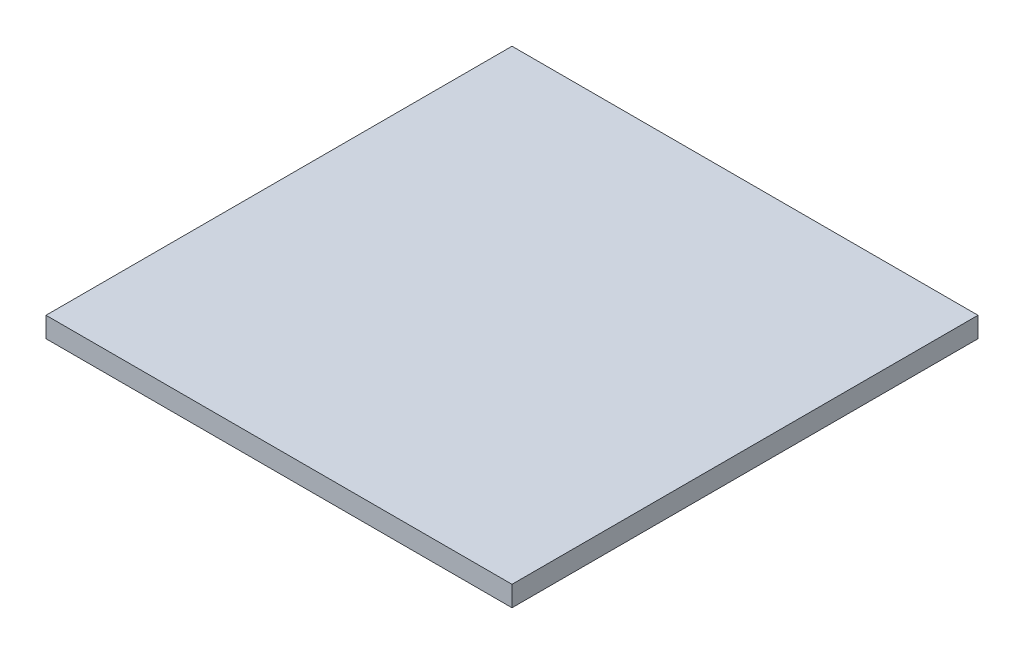
ISO-10303-21;
HEADER;
FILE_DESCRIPTION(('STEP AP214'),'2;1');
FILE_NAME('part.step','',(''),(''),'','','');
FILE_SCHEMA(('AUTOMOTIVE_DESIGN { 1 0 10303 214 1 1 1 1 }'));
ENDSEC;
DATA;
#1=APPLICATION_CONTEXT('core data for automotive mechanical design processes');
#2=APPLICATION_PROTOCOL_DEFINITION('international standard','automotive_design',2000,#1);
#3=PRODUCT_CONTEXT('',#1,'mechanical');
#4=PRODUCT('Part','Part','',(#3));
#5=PRODUCT_RELATED_PRODUCT_CATEGORY('part','',(#4));
#6=PRODUCT_DEFINITION_FORMATION('','',#4);
#7=PRODUCT_DEFINITION_CONTEXT('part definition',#1,'design');
#8=PRODUCT_DEFINITION('design','',#6,#7);
#9=PRODUCT_DEFINITION_SHAPE('','',#8);
#10=(LENGTH_UNIT() NAMED_UNIT(*) SI_UNIT(.MILLI.,.METRE.));
#11=(NAMED_UNIT(*) PLANE_ANGLE_UNIT() SI_UNIT($,.RADIAN.));
#12=(NAMED_UNIT(*) SI_UNIT($,.STERADIAN.) SOLID_ANGLE_UNIT());
#13=UNCERTAINTY_MEASURE_WITH_UNIT(LENGTH_MEASURE(1.E-05),#10,'distance_accuracy_value','');
#14=(GEOMETRIC_REPRESENTATION_CONTEXT(3) GLOBAL_UNCERTAINTY_ASSIGNED_CONTEXT((#13)) GLOBAL_UNIT_ASSIGNED_CONTEXT((#10,
#11,#12)) REPRESENTATION_CONTEXT('',''));
#15=CARTESIAN_POINT('',(0.,0.,0.));
#16=DIRECTION('',(0.,0.,1.));
#17=DIRECTION('',(1.,0.,0.));
#18=AXIS2_PLACEMENT_3D('',#15,#16,#17);
#19=CARTESIAN_POINT('',(57.25,5.,57.25));
#20=DIRECTION('',(-1.,0.,0.));
#21=DIRECTION('',(0.,0.,1.));
#22=AXIS2_PLACEMENT_3D('',#19,#20,#21);
#23=PLANE('',#22);
#24=DIRECTION('',(0.,0.,-1.));
#25=VECTOR('',#24,1.);
#26=CARTESIAN_POINT('',(57.25,0.,57.25));
#27=LINE('',#26,#25);
#28=CARTESIAN_POINT('',(57.25,0.,57.25));
#29=VERTEX_POINT('',#28);
#30=CARTESIAN_POINT('',(57.25,0.,-57.25));
#31=VERTEX_POINT('',#30);
#32=EDGE_CURVE('E98',#29,#31,#27,.T.);
#33=ORIENTED_EDGE('',*,*,#32,.T.);
#34=DIRECTION('',(0.,-1.,0.));
#35=VECTOR('',#34,1.);
#36=CARTESIAN_POINT('',(57.25,5.,-57.25));
#37=LINE('',#36,#35);
#38=CARTESIAN_POINT('',(57.25,5.,-57.25));
#39=VERTEX_POINT('',#38);
#40=EDGE_CURVE('E11',#39,#31,#37,.T.);
#41=ORIENTED_EDGE('',*,*,#40,.F.);
#42=DIRECTION('',(0.,0.,-1.));
#43=VECTOR('',#42,1.);
#44=CARTESIAN_POINT('',(57.25,5.,57.25));
#45=LINE('',#44,#43);
#46=CARTESIAN_POINT('',(57.25,5.,57.25));
#47=VERTEX_POINT('',#46);
#48=EDGE_CURVE('E86',#47,#39,#45,.T.);
#49=ORIENTED_EDGE('',*,*,#48,.F.);
#50=DIRECTION('',(0.,-1.,0.));
#51=VECTOR('',#50,1.);
#52=CARTESIAN_POINT('',(57.25,5.,57.25));
#53=LINE('',#52,#51);
#54=EDGE_CURVE('E94',#47,#29,#53,.T.);
#55=ORIENTED_EDGE('',*,*,#54,.T.);
#56=EDGE_LOOP('',(#33,#41,#49,#55));
#57=FACE_BOUND('',#56,.T.);
#58=ADVANCED_FACE('F35',(#57),#23,.F.);
#59=CARTESIAN_POINT('',(-57.25,5.,-57.25));
#60=DIRECTION('',(0.,0.,1.));
#61=DIRECTION('',(1.,0.,0.));
#62=AXIS2_PLACEMENT_3D('',#59,#60,#61);
#63=PLANE('',#62);
#64=DIRECTION('',(-1.,0.,0.));
#65=VECTOR('',#64,1.);
#66=CARTESIAN_POINT('',(-57.25,0.,-57.25));
#67=LINE('',#66,#65);
#68=CARTESIAN_POINT('',(-57.25,0.,-57.25));
#69=VERTEX_POINT('',#68);
#70=EDGE_CURVE('E90',#31,#69,#67,.T.);
#71=ORIENTED_EDGE('',*,*,#70,.T.);
#72=DIRECTION('',(0.,-1.,0.));
#73=VECTOR('',#72,1.);
#74=CARTESIAN_POINT('',(-57.25,5.,-57.25));
#75=LINE('',#74,#73);
#76=CARTESIAN_POINT('',(-57.25,5.,-57.25));
#77=VERTEX_POINT('',#76);
#78=EDGE_CURVE('E43',#77,#69,#75,.T.);
#79=ORIENTED_EDGE('',*,*,#78,.F.);
#80=DIRECTION('',(-1.,0.,0.));
#81=VECTOR('',#80,1.);
#82=CARTESIAN_POINT('',(-57.25,5.,-57.25));
#83=LINE('',#82,#81);
#84=EDGE_CURVE('E81',#39,#77,#83,.T.);
#85=ORIENTED_EDGE('',*,*,#84,.F.);
#86=ORIENTED_EDGE('',*,*,#40,.T.);
#87=EDGE_LOOP('',(#71,#79,#85,#86));
#88=FACE_BOUND('',#87,.T.);
#89=ADVANCED_FACE('F89',(#88),#63,.F.);
#90=CARTESIAN_POINT('',(-57.25,5.,57.25));
#91=DIRECTION('',(1.,0.,0.));
#92=DIRECTION('',(0.,0.,-1.));
#93=AXIS2_PLACEMENT_3D('',#90,#91,#92);
#94=PLANE('',#93);
#95=DIRECTION('',(0.,0.,1.));
#96=VECTOR('',#95,1.);
#97=CARTESIAN_POINT('',(-57.25,0.,57.25));
#98=LINE('',#97,#96);
#99=CARTESIAN_POINT('',(-57.25,0.,57.25));
#100=VERTEX_POINT('',#99);
#101=EDGE_CURVE('E68',#69,#100,#98,.T.);
#102=ORIENTED_EDGE('',*,*,#101,.T.);
#103=DIRECTION('',(0.,-1.,0.));
#104=VECTOR('',#103,1.);
#105=CARTESIAN_POINT('',(-57.25,5.,57.25));
#106=LINE('',#105,#104);
#107=CARTESIAN_POINT('',(-57.25,5.,57.25));
#108=VERTEX_POINT('',#107);
#109=EDGE_CURVE('E91',#108,#100,#106,.T.);
#110=ORIENTED_EDGE('',*,*,#109,.F.);
#111=DIRECTION('',(0.,0.,1.));
#112=VECTOR('',#111,1.);
#113=CARTESIAN_POINT('',(-57.25,5.,57.25));
#114=LINE('',#113,#112);
#115=EDGE_CURVE('E84',#77,#108,#114,.T.);
#116=ORIENTED_EDGE('',*,*,#115,.F.);
#117=ORIENTED_EDGE('',*,*,#78,.T.);
#118=EDGE_LOOP('',(#102,#110,#116,#117));
#119=FACE_BOUND('',#118,.T.);
#120=ADVANCED_FACE('F92',(#119),#94,.F.);
#121=CARTESIAN_POINT('',(-57.25,5.,57.25));
#122=DIRECTION('',(0.,0.,-1.));
#123=DIRECTION('',(-1.,0.,0.));
#124=AXIS2_PLACEMENT_3D('',#121,#122,#123);
#125=PLANE('',#124);
#126=DIRECTION('',(1.,0.,0.));
#127=VECTOR('',#126,1.);
#128=CARTESIAN_POINT('',(-57.25,0.,57.25));
#129=LINE('',#128,#127);
#130=EDGE_CURVE('E74',#100,#29,#129,.T.);
#131=ORIENTED_EDGE('',*,*,#130,.T.);
#132=ORIENTED_EDGE('',*,*,#54,.F.);
#133=DIRECTION('',(1.,0.,0.));
#134=VECTOR('',#133,1.);
#135=CARTESIAN_POINT('',(-57.25,5.,57.25));
#136=LINE('',#135,#134);
#137=EDGE_CURVE('E51',#108,#47,#136,.T.);
#138=ORIENTED_EDGE('',*,*,#137,.F.);
#139=ORIENTED_EDGE('',*,*,#109,.T.);
#140=EDGE_LOOP('',(#131,#132,#138,#139));
#141=FACE_BOUND('',#140,.T.);
#142=ADVANCED_FACE('F105',(#141),#125,.F.);
#143=CARTESIAN_POINT('',(0.,5.,0.));
#144=DIRECTION('',(0.,-1.,0.));
#145=DIRECTION('',(0.,0.,-1.));
#146=AXIS2_PLACEMENT_3D('',#143,#144,#145);
#147=PLANE('',#146);
#148=ORIENTED_EDGE('',*,*,#48,.T.);
#149=ORIENTED_EDGE('',*,*,#84,.T.);
#150=ORIENTED_EDGE('',*,*,#115,.T.);
#151=ORIENTED_EDGE('',*,*,#137,.T.);
#152=EDGE_LOOP('',(#148,#149,#150,#151));
#153=FACE_BOUND('',#152,.T.);
#154=ADVANCED_FACE('F82',(#153),#147,.F.);
#155=CARTESIAN_POINT('',(0.,0.,0.));
#156=DIRECTION('',(0.,-1.,0.));
#157=DIRECTION('',(0.,0.,-1.));
#158=AXIS2_PLACEMENT_3D('',#155,#156,#157);
#159=PLANE('',#158);
#160=ORIENTED_EDGE('',*,*,#32,.F.);
#161=ORIENTED_EDGE('',*,*,#130,.F.);
#162=ORIENTED_EDGE('',*,*,#101,.F.);
#163=ORIENTED_EDGE('',*,*,#70,.F.);
#164=EDGE_LOOP('',(#160,#161,#162,#163));
#165=FACE_BOUND('',#164,.T.);
#166=ADVANCED_FACE('F108',(#165),#159,.T.);
#167=CLOSED_SHELL('',(#58,#89,#120,#142,#154,#166));
#168=MANIFOLD_SOLID_BREP('B2',#167);
#169=ADVANCED_BREP_SHAPE_REPRESENTATION('',(#18,#168),#14);
#170=SHAPE_DEFINITION_REPRESENTATION(#9,#169);
ENDSEC;
END-ISO-10303-21;
